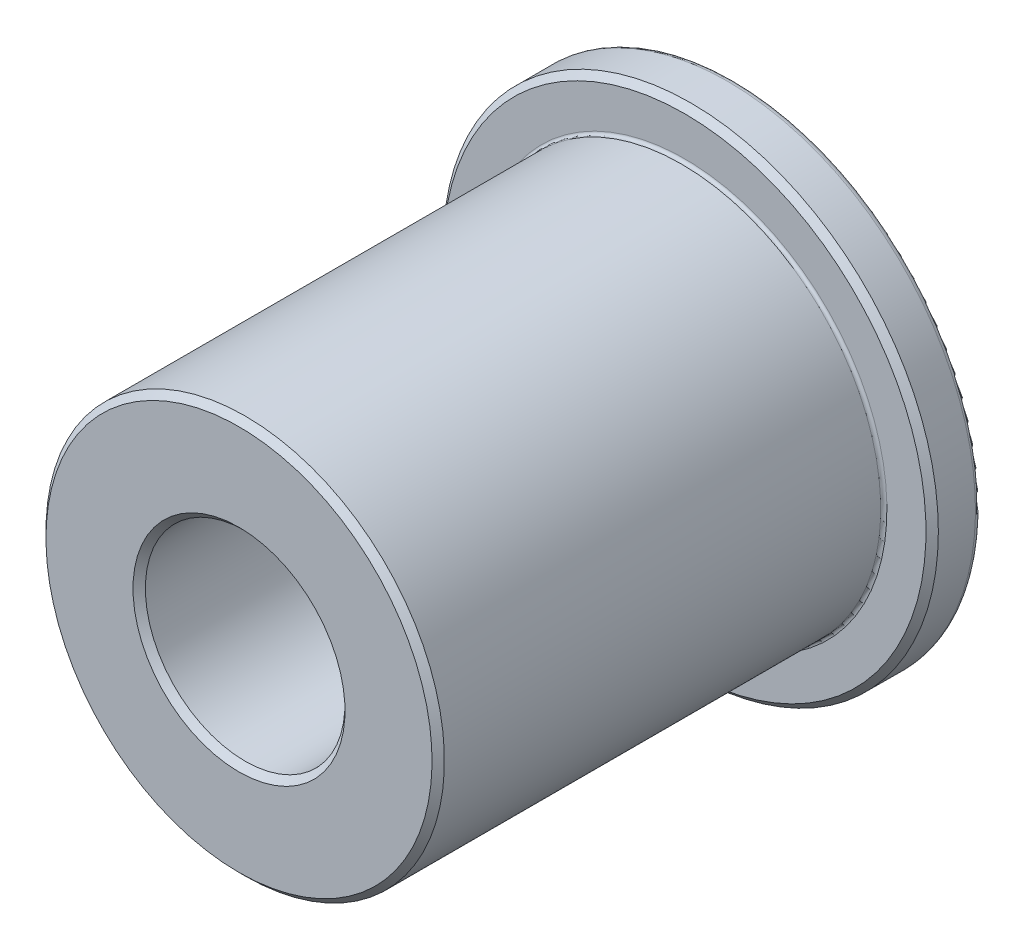
ISO-10303-21;
HEADER;
FILE_DESCRIPTION(('STEP AP214'),'2;1');
FILE_NAME('part.step','',(''),(''),'','','');
FILE_SCHEMA(('AUTOMOTIVE_DESIGN { 1 0 10303 214 1 1 1 1 }'));
ENDSEC;
DATA;
#1=APPLICATION_CONTEXT('core data for automotive mechanical design processes');
#2=APPLICATION_PROTOCOL_DEFINITION('international standard','automotive_design',2000,#1);
#3=PRODUCT_CONTEXT('',#1,'mechanical');
#4=PRODUCT('Part','Part','',(#3));
#5=PRODUCT_RELATED_PRODUCT_CATEGORY('part','',(#4));
#6=PRODUCT_DEFINITION_FORMATION('','',#4);
#7=PRODUCT_DEFINITION_CONTEXT('part definition',#1,'design');
#8=PRODUCT_DEFINITION('design','',#6,#7);
#9=PRODUCT_DEFINITION_SHAPE('','',#8);
#10=(LENGTH_UNIT() NAMED_UNIT(*) SI_UNIT(.MILLI.,.METRE.));
#11=(NAMED_UNIT(*) PLANE_ANGLE_UNIT() SI_UNIT($,.RADIAN.));
#12=(NAMED_UNIT(*) SI_UNIT($,.STERADIAN.) SOLID_ANGLE_UNIT());
#13=UNCERTAINTY_MEASURE_WITH_UNIT(LENGTH_MEASURE(1.E-05),#10,'distance_accuracy_value','');
#14=(GEOMETRIC_REPRESENTATION_CONTEXT(3) GLOBAL_UNCERTAINTY_ASSIGNED_CONTEXT((#13)) GLOBAL_UNIT_ASSIGNED_CONTEXT((#10,
#11,#12)) REPRESENTATION_CONTEXT('',''));
#15=CARTESIAN_POINT('',(0.,0.,0.));
#16=DIRECTION('',(0.,0.,1.));
#17=DIRECTION('',(1.,0.,0.));
#18=AXIS2_PLACEMENT_3D('',#15,#16,#17);
#19=CARTESIAN_POINT('',(0.,7.9375,-7.9375));
#20=DIRECTION('',(0.,0.,-1.));
#21=DIRECTION('',(0.,1.,0.));
#22=AXIS2_PLACEMENT_3D('',#19,#20,#21);
#23=PLANE('',#22);
#24=CARTESIAN_POINT('',(0.,0.,-7.9375));
#25=DIRECTION('',(0.,0.,-1.));
#26=DIRECTION('',(0.,1.,0.));
#27=AXIS2_PLACEMENT_3D('',#24,#25,#26);
#28=CIRCLE('',#27,7.7390625);
#29=CARTESIAN_POINT('',(0.,7.7390625,-7.9375));
#30=VERTEX_POINT('',#29);
#31=EDGE_CURVE('E47',#30,#30,#28,.T.);
#32=ORIENTED_EDGE('',*,*,#31,.T.);
#33=EDGE_LOOP('',(#32));
#34=FACE_BOUND('',#33,.T.);
#35=CARTESIAN_POINT('',(0.,0.,-7.9375));
#36=DIRECTION('',(0.,0.,-1.));
#37=DIRECTION('',(0.,1.,0.));
#38=AXIS2_PLACEMENT_3D('',#35,#36,#37);
#39=CIRCLE('',#38,3.2004);
#40=CARTESIAN_POINT('',(0.,3.2004,-7.9375));
#41=VERTEX_POINT('',#40);
#42=EDGE_CURVE('E70',#41,#41,#39,.T.);
#43=ORIENTED_EDGE('',*,*,#42,.F.);
#44=EDGE_LOOP('',(#43));
#45=FACE_BOUND('',#44,.T.);
#46=ADVANCED_FACE('F32',(#34,#45),#23,.T.);
#47=CARTESIAN_POINT('',(0.,0.,-7.9375));
#48=DIRECTION('',(0.,0.,-1.));
#49=DIRECTION('',(0.,1.,0.));
#50=AXIS2_PLACEMENT_3D('',#47,#48,#49);
#51=CYLINDRICAL_SURFACE('',#50,7.9375);
#52=CARTESIAN_POINT('',(0.,0.,-7.7390625));
#53=DIRECTION('',(0.,0.,-1.));
#54=DIRECTION('',(0.,1.,0.));
#55=AXIS2_PLACEMENT_3D('',#52,#53,#54);
#56=CIRCLE('',#55,7.9375);
#57=CARTESIAN_POINT('',(0.,7.9375,-7.7390625));
#58=VERTEX_POINT('',#57);
#59=EDGE_CURVE('E43',#58,#58,#56,.F.);
#60=ORIENTED_EDGE('',*,*,#59,.T.);
#61=EDGE_LOOP('',(#60));
#62=FACE_BOUND('',#61,.T.);
#63=CARTESIAN_POINT('',(0.,0.,-6.54843749999999));
#64=DIRECTION('',(0.,0.,1.));
#65=DIRECTION('',(0.,-1.,0.));
#66=AXIS2_PLACEMENT_3D('',#63,#64,#65);
#67=CIRCLE('',#66,7.9375);
#68=CARTESIAN_POINT('',(0.,-7.9375,-6.54843749999999));
#69=VERTEX_POINT('',#68);
#70=EDGE_CURVE('E67',#69,#69,#67,.F.);
#71=ORIENTED_EDGE('',*,*,#70,.T.);
#72=EDGE_LOOP('',(#71));
#73=FACE_BOUND('',#72,.T.);
#74=ADVANCED_FACE('F77',(#62,#73),#51,.T.);
#75=CARTESIAN_POINT('',(0.,7.9375,-6.35));
#76=DIRECTION('',(0.,0.,1.));
#77=DIRECTION('',(0.,-1.,0.));
#78=AXIS2_PLACEMENT_3D('',#75,#76,#77);
#79=PLANE('',#78);
#80=CARTESIAN_POINT('',(0.,0.,-6.35));
#81=DIRECTION('',(0.,0.,1.));
#82=DIRECTION('',(0.,-1.,0.));
#83=AXIS2_PLACEMENT_3D('',#80,#81,#82);
#84=CIRCLE('',#83,6.48731875);
#85=CARTESIAN_POINT('',(0.,-6.48731875,-6.35));
#86=VERTEX_POINT('',#85);
#87=EDGE_CURVE('E39',#86,#86,#84,.F.);
#88=ORIENTED_EDGE('',*,*,#87,.T.);
#89=EDGE_LOOP('',(#88));
#90=FACE_BOUND('',#89,.T.);
#91=CARTESIAN_POINT('',(0.,0.,-6.35));
#92=DIRECTION('',(0.,0.,1.));
#93=DIRECTION('',(0.,-1.,0.));
#94=AXIS2_PLACEMENT_3D('',#91,#92,#93);
#95=CIRCLE('',#94,7.73906250000001);
#96=CARTESIAN_POINT('',(0.,-7.7390625,-6.35));
#97=VERTEX_POINT('',#96);
#98=EDGE_CURVE('E64',#97,#97,#95,.T.);
#99=ORIENTED_EDGE('',*,*,#98,.T.);
#100=EDGE_LOOP('',(#99));
#101=FACE_BOUND('',#100,.T.);
#102=ADVANCED_FACE('F83',(#90,#101),#79,.T.);
#103=CARTESIAN_POINT('',(0.,0.,-7.9375));
#104=DIRECTION('',(0.,0.,-1.));
#105=DIRECTION('',(0.,1.,0.));
#106=AXIS2_PLACEMENT_3D('',#103,#104,#105);
#107=CYLINDRICAL_SURFACE('',#106,6.3881);
#108=CARTESIAN_POINT('',(0.,0.,-6.25078125));
#109=DIRECTION('',(0.,0.,1.));
#110=DIRECTION('',(0.,-1.,0.));
#111=AXIS2_PLACEMENT_3D('',#108,#109,#110);
#112=CIRCLE('',#111,6.3881);
#113=CARTESIAN_POINT('',(0.,-6.3881,-6.25078125));
#114=VERTEX_POINT('',#113);
#115=EDGE_CURVE('E10',#114,#114,#112,.T.);
#116=ORIENTED_EDGE('',*,*,#115,.T.);
#117=EDGE_LOOP('',(#116));
#118=FACE_BOUND('',#117,.T.);
#119=CARTESIAN_POINT('',(0.,0.,7.7390625));
#120=DIRECTION('',(0.,0.,1.));
#121=DIRECTION('',(0.,-1.,0.));
#122=AXIS2_PLACEMENT_3D('',#119,#120,#121);
#123=CIRCLE('',#122,6.3881);
#124=CARTESIAN_POINT('',(0.,-6.3881,7.7390625));
#125=VERTEX_POINT('',#124);
#126=EDGE_CURVE('E61',#125,#125,#123,.F.);
#127=ORIENTED_EDGE('',*,*,#126,.T.);
#128=EDGE_LOOP('',(#127));
#129=FACE_BOUND('',#128,.T.);
#130=ADVANCED_FACE('F121',(#118,#129),#107,.T.);
#131=CARTESIAN_POINT('',(0.,6.3881,7.9375));
#132=DIRECTION('',(0.,0.,1.));
#133=DIRECTION('',(0.,-1.,0.));
#134=AXIS2_PLACEMENT_3D('',#131,#132,#133);
#135=PLANE('',#134);
#136=CARTESIAN_POINT('',(0.,0.,7.9375));
#137=DIRECTION('',(0.,0.,1.));
#138=DIRECTION('',(0.,-1.,0.));
#139=AXIS2_PLACEMENT_3D('',#136,#137,#138);
#140=CIRCLE('',#139,6.1896625);
#141=CARTESIAN_POINT('',(0.,-6.1896625,7.9375));
#142=VERTEX_POINT('',#141);
#143=EDGE_CURVE('E55',#142,#142,#140,.T.);
#144=ORIENTED_EDGE('',*,*,#143,.T.);
#145=EDGE_LOOP('',(#144));
#146=FACE_BOUND('',#145,.T.);
#147=CARTESIAN_POINT('',(0.,0.,7.9375));
#148=DIRECTION('',(0.,0.,1.));
#149=DIRECTION('',(0.,-1.,0.));
#150=AXIS2_PLACEMENT_3D('',#147,#148,#149);
#151=CIRCLE('',#150,3.3988375);
#152=CARTESIAN_POINT('',(0.,-3.3988375,7.9375));
#153=VERTEX_POINT('',#152);
#154=EDGE_CURVE('E58',#153,#153,#151,.F.);
#155=ORIENTED_EDGE('',*,*,#154,.T.);
#156=EDGE_LOOP('',(#155));
#157=FACE_BOUND('',#156,.T.);
#158=ADVANCED_FACE('F126',(#146,#157),#135,.T.);
#159=CARTESIAN_POINT('',(0.,0.,-7.9375));
#160=DIRECTION('',(0.,0.,-1.));
#161=DIRECTION('',(0.,1.,0.));
#162=AXIS2_PLACEMENT_3D('',#159,#160,#161);
#163=CYLINDRICAL_SURFACE('',#162,3.2004);
#164=CARTESIAN_POINT('',(0.,0.,7.7390625));
#165=DIRECTION('',(0.,0.,1.));
#166=DIRECTION('',(0.,-1.,0.));
#167=AXIS2_PLACEMENT_3D('',#164,#165,#166);
#168=CIRCLE('',#167,3.2004);
#169=CARTESIAN_POINT('',(0.,-3.2004,7.7390625));
#170=VERTEX_POINT('',#169);
#171=EDGE_CURVE('E52',#170,#170,#168,.T.);
#172=ORIENTED_EDGE('',*,*,#171,.T.);
#173=EDGE_LOOP('',(#172));
#174=FACE_BOUND('',#173,.T.);
#175=ORIENTED_EDGE('',*,*,#42,.T.);
#176=EDGE_LOOP('',(#175));
#177=FACE_BOUND('',#176,.T.);
#178=ADVANCED_FACE('F74',(#174,#177),#163,.F.);
#179=CARTESIAN_POINT('',(0.,0.,-6.54843749999999));
#180=DIRECTION('',(0.,0.,-1.));
#181=DIRECTION('',(0.,1.,0.));
#182=AXIS2_PLACEMENT_3D('',#179,#180,#181);
#183=CONICAL_SURFACE('',#182,7.9375,0.785398163397448);
#184=ORIENTED_EDGE('',*,*,#98,.F.);
#185=EDGE_LOOP('',(#184));
#186=FACE_BOUND('',#185,.T.);
#187=ORIENTED_EDGE('',*,*,#70,.F.);
#188=EDGE_LOOP('',(#187));
#189=FACE_BOUND('',#188,.T.);
#190=ADVANCED_FACE('F88',(#186,#189),#183,.T.);
#191=CARTESIAN_POINT('',(0.,0.,7.7390625));
#192=DIRECTION('',(0.,0.,-1.));
#193=DIRECTION('',(0.,1.,0.));
#194=AXIS2_PLACEMENT_3D('',#191,#192,#193);
#195=CONICAL_SURFACE('',#194,6.3881,0.785398163397446);
#196=ORIENTED_EDGE('',*,*,#143,.F.);
#197=EDGE_LOOP('',(#196));
#198=FACE_BOUND('',#197,.T.);
#199=ORIENTED_EDGE('',*,*,#126,.F.);
#200=EDGE_LOOP('',(#199));
#201=FACE_BOUND('',#200,.T.);
#202=ADVANCED_FACE('F91',(#198,#201),#195,.T.);
#203=CARTESIAN_POINT('',(0.,0.,7.9375));
#204=DIRECTION('',(0.,0.,1.));
#205=DIRECTION('',(0.,-1.,0.));
#206=AXIS2_PLACEMENT_3D('',#203,#204,#205);
#207=CONICAL_SURFACE('',#206,3.3988375,0.785398163397445);
#208=ORIENTED_EDGE('',*,*,#171,.F.);
#209=EDGE_LOOP('',(#208));
#210=FACE_BOUND('',#209,.T.);
#211=ORIENTED_EDGE('',*,*,#154,.F.);
#212=EDGE_LOOP('',(#211));
#213=FACE_BOUND('',#212,.T.);
#214=ADVANCED_FACE('F95',(#210,#213),#207,.F.);
#215=CARTESIAN_POINT('',(0.,0.,-7.7390625));
#216=DIRECTION('',(0.,0.,-1.));
#217=DIRECTION('',(0.,1.,0.));
#218=AXIS2_PLACEMENT_3D('',#215,#216,#217);
#219=TOROIDAL_SURFACE('',#218,7.7390625,0.1984375);
#220=ORIENTED_EDGE('',*,*,#59,.F.);
#221=EDGE_LOOP('',(#220));
#222=FACE_BOUND('',#221,.T.);
#223=ORIENTED_EDGE('',*,*,#31,.F.);
#224=EDGE_LOOP('',(#223));
#225=FACE_BOUND('',#224,.T.);
#226=ADVANCED_FACE('F98',(#222,#225),#219,.T.);
#227=CARTESIAN_POINT('',(0.,0.,-6.25078125));
#228=DIRECTION('',(0.,0.,1.));
#229=DIRECTION('',(0.,-1.,0.));
#230=AXIS2_PLACEMENT_3D('',#227,#228,#229);
#231=TOROIDAL_SURFACE('',#230,6.48731875,0.09921875);
#232=ORIENTED_EDGE('',*,*,#115,.F.);
#233=EDGE_LOOP('',(#232));
#234=FACE_BOUND('',#233,.T.);
#235=ORIENTED_EDGE('',*,*,#87,.F.);
#236=EDGE_LOOP('',(#235));
#237=FACE_BOUND('',#236,.T.);
#238=ADVANCED_FACE('F34',(#234,#237),#231,.F.);
#239=CLOSED_SHELL('',(#46,#74,#102,#130,#158,#178,#190,#202,#214,#226,#238));
#240=MANIFOLD_SOLID_BREP('B2',#239);
#241=ADVANCED_BREP_SHAPE_REPRESENTATION('',(#18,#240),#14);
#242=SHAPE_DEFINITION_REPRESENTATION(#9,#241);
ENDSEC;
END-ISO-10303-21;
